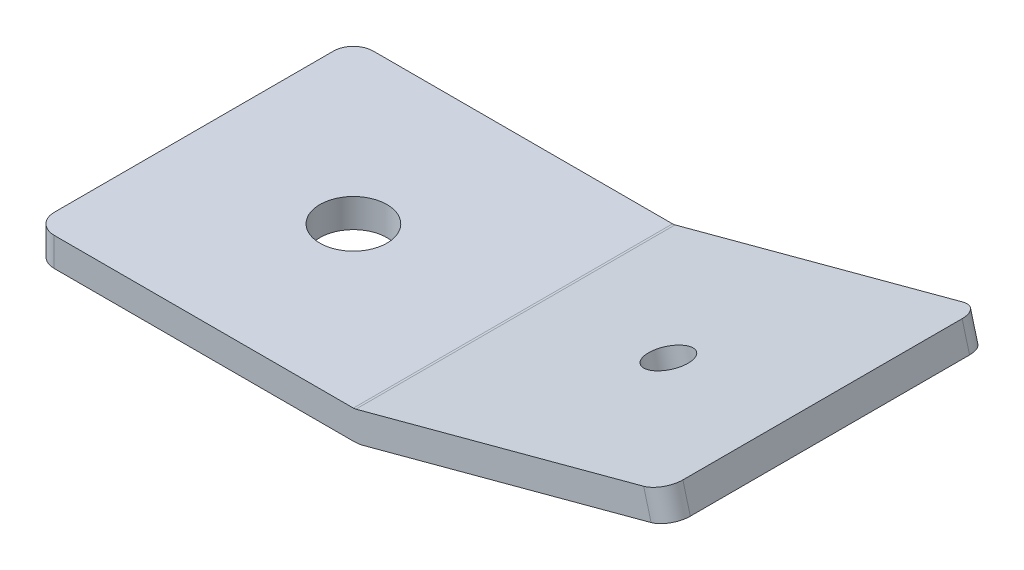
ISO-10303-21;
HEADER;
FILE_DESCRIPTION(('STEP AP214'),'2;1');
FILE_NAME('part.step','',(''),(''),'','','');
FILE_SCHEMA(('AUTOMOTIVE_DESIGN { 1 0 10303 214 1 1 1 1 }'));
ENDSEC;
DATA;
#1=APPLICATION_CONTEXT('core data for automotive mechanical design processes');
#2=APPLICATION_PROTOCOL_DEFINITION('international standard','automotive_design',2000,#1);
#3=PRODUCT_CONTEXT('',#1,'mechanical');
#4=PRODUCT('Part','Part','',(#3));
#5=PRODUCT_RELATED_PRODUCT_CATEGORY('part','',(#4));
#6=PRODUCT_DEFINITION_FORMATION('','',#4);
#7=PRODUCT_DEFINITION_CONTEXT('part definition',#1,'design');
#8=PRODUCT_DEFINITION('design','',#6,#7);
#9=PRODUCT_DEFINITION_SHAPE('','',#8);
#10=(LENGTH_UNIT() NAMED_UNIT(*) SI_UNIT(.MILLI.,.METRE.));
#11=(NAMED_UNIT(*) PLANE_ANGLE_UNIT() SI_UNIT($,.RADIAN.));
#12=(NAMED_UNIT(*) SI_UNIT($,.STERADIAN.) SOLID_ANGLE_UNIT());
#13=UNCERTAINTY_MEASURE_WITH_UNIT(LENGTH_MEASURE(1.E-05),#10,'distance_accuracy_value','');
#14=(GEOMETRIC_REPRESENTATION_CONTEXT(3) GLOBAL_UNCERTAINTY_ASSIGNED_CONTEXT((#13)) GLOBAL_UNIT_ASSIGNED_CONTEXT((#10,
#11,#12)) REPRESENTATION_CONTEXT('',''));
#15=CARTESIAN_POINT('',(0.,0.,0.));
#16=DIRECTION('',(0.,0.,1.));
#17=DIRECTION('',(1.,0.,0.));
#18=AXIS2_PLACEMENT_3D('',#15,#16,#17);
#19=CARTESIAN_POINT('',(0.,0.,-1.5875));
#20=DIRECTION('',(1.,0.,0.));
#21=DIRECTION('',(0.,0.,-1.));
#22=AXIS2_PLACEMENT_3D('',#19,#20,#21);
#23=PLANE('',#22);
#24=DIRECTION('',(0.,1.,0.));
#25=VECTOR('',#24,1.);
#26=CARTESIAN_POINT('',(0.,1.143,-23.8125000006107));
#27=LINE('',#26,#25);
#28=CARTESIAN_POINT('',(0.,2.286,-23.8125000003053));
#29=VERTEX_POINT('',#28);
#30=CARTESIAN_POINT('',(0.,0.,-23.8125000003053));
#31=VERTEX_POINT('',#30);
#32=EDGE_CURVE('E115',#29,#31,#27,.F.);
#33=ORIENTED_EDGE('',*,*,#32,.T.);
#34=DIRECTION('',(0.,0.,-1.));
#35=VECTOR('',#34,1.);
#36=CARTESIAN_POINT('',(0.,0.,-12.7));
#37=LINE('',#36,#35);
#38=CARTESIAN_POINT('',(0.,0.,-1.58750000030535));
#39=VERTEX_POINT('',#38);
#40=EDGE_CURVE('E159',#39,#31,#37,.T.);
#41=ORIENTED_EDGE('',*,*,#40,.F.);
#42=DIRECTION('',(0.,-1.,0.));
#43=VECTOR('',#42,1.);
#44=CARTESIAN_POINT('',(0.,1.143,-1.58750000061069));
#45=LINE('',#44,#43);
#46=CARTESIAN_POINT('',(0.,2.286,-1.58750000030535));
#47=VERTEX_POINT('',#46);
#48=EDGE_CURVE('E92',#39,#47,#45,.F.);
#49=ORIENTED_EDGE('',*,*,#48,.T.);
#50=DIRECTION('',(0.,0.,-1.));
#51=VECTOR('',#50,1.);
#52=CARTESIAN_POINT('',(0.,2.286,-12.7));
#53=LINE('',#52,#51);
#54=EDGE_CURVE('E89',#47,#29,#53,.T.);
#55=ORIENTED_EDGE('',*,*,#54,.T.);
#56=EDGE_LOOP('',(#33,#41,#49,#55));
#57=FACE_BOUND('',#56,.T.);
#58=ADVANCED_FACE('F17',(#57),#23,.F.);
#59=CARTESIAN_POINT('',(12.7,0.,-12.7));
#60=DIRECTION('',(0.,1.,0.));
#61=DIRECTION('',(0.,0.,1.));
#62=AXIS2_PLACEMENT_3D('',#59,#60,#61);
#63=CYLINDRICAL_SURFACE('',#62,2.667);
#64=CARTESIAN_POINT('',(12.7,2.286,-12.7));
#65=DIRECTION('',(0.,1.,0.));
#66=DIRECTION('',(0.,0.,1.));
#67=AXIS2_PLACEMENT_3D('',#64,#65,#66);
#68=CIRCLE('',#67,2.667);
#69=CARTESIAN_POINT('',(12.7,2.286,-10.033));
#70=VERTEX_POINT('',#69);
#71=EDGE_CURVE('E161',#70,#70,#68,.T.);
#72=ORIENTED_EDGE('',*,*,#71,.T.);
#73=EDGE_LOOP('',(#72));
#74=FACE_BOUND('',#73,.T.);
#75=CARTESIAN_POINT('',(12.7,0.,-12.7));
#76=DIRECTION('',(0.,1.,0.));
#77=DIRECTION('',(0.,0.,1.));
#78=AXIS2_PLACEMENT_3D('',#75,#76,#77);
#79=CIRCLE('',#78,2.667);
#80=CARTESIAN_POINT('',(12.7,0.,-10.033));
#81=VERTEX_POINT('',#80);
#82=EDGE_CURVE('E153',#81,#81,#79,.T.);
#83=ORIENTED_EDGE('',*,*,#82,.F.);
#84=EDGE_LOOP('',(#83));
#85=FACE_BOUND('',#84,.T.);
#86=ADVANCED_FACE('F288',(#74,#85),#63,.F.);
#87=CARTESIAN_POINT('',(1.5875,0.,-1.5875));
#88=DIRECTION('',(0.,1.,0.));
#89=DIRECTION('',(0.,0.,1.));
#90=AXIS2_PLACEMENT_3D('',#87,#88,#89);
#91=CYLINDRICAL_SURFACE('',#90,1.5875);
#92=CARTESIAN_POINT('',(1.5875,0.,-1.5875));
#93=DIRECTION('',(0.,1.,0.));
#94=DIRECTION('',(0.,0.,1.));
#95=AXIS2_PLACEMENT_3D('',#92,#93,#94);
#96=CIRCLE('',#95,1.5875);
#97=CARTESIAN_POINT('',(1.5875,0.,0.));
#98=VERTEX_POINT('',#97);
#99=EDGE_CURVE('E106',#98,#39,#96,.F.);
#100=ORIENTED_EDGE('',*,*,#99,.F.);
#101=DIRECTION('',(0.,1.,0.));
#102=VECTOR('',#101,1.);
#103=CARTESIAN_POINT('',(1.5875,4.2499116415,0.));
#104=LINE('',#103,#102);
#105=CARTESIAN_POINT('',(1.5875,2.286000000267,0.));
#106=VERTEX_POINT('',#105);
#107=EDGE_CURVE('E98',#98,#106,#104,.T.);
#108=ORIENTED_EDGE('',*,*,#107,.T.);
#109=CARTESIAN_POINT('',(1.5875,2.286,-1.5875));
#110=DIRECTION('',(0.,1.,0.));
#111=DIRECTION('',(0.,0.,1.));
#112=AXIS2_PLACEMENT_3D('',#109,#110,#111);
#113=CIRCLE('',#112,1.5875);
#114=EDGE_CURVE('E21',#106,#47,#113,.F.);
#115=ORIENTED_EDGE('',*,*,#114,.T.);
#116=ORIENTED_EDGE('',*,*,#48,.F.);
#117=EDGE_LOOP('',(#100,#108,#115,#116));
#118=FACE_BOUND('',#117,.T.);
#119=ADVANCED_FACE('F104',(#118),#91,.T.);
#120=CARTESIAN_POINT('',(0.,2.286,0.));
#121=DIRECTION('',(0.,-1.,0.));
#122=DIRECTION('',(0.,0.,-1.));
#123=AXIS2_PLACEMENT_3D('',#120,#121,#122);
#124=PLANE('',#123);
#125=ORIENTED_EDGE('',*,*,#71,.F.);
#126=EDGE_LOOP('',(#125));
#127=FACE_BOUND('',#126,.T.);
#128=DIRECTION('',(0.,0.,-1.));
#129=VECTOR('',#128,1.);
#130=CARTESIAN_POINT('',(25.4000000002931,2.28600000000001,-12.7));
#131=LINE('',#130,#129);
#132=CARTESIAN_POINT('',(25.4000000001466,2.286000000267,-25.4));
#133=VERTEX_POINT('',#132);
#134=CARTESIAN_POINT('',(25.4000000001466,2.286000000267,0.));
#135=VERTEX_POINT('',#134);
#136=EDGE_CURVE('E113',#133,#135,#131,.F.);
#137=ORIENTED_EDGE('',*,*,#136,.F.);
#138=DIRECTION('',(-1.,0.,0.));
#139=VECTOR('',#138,1.);
#140=CARTESIAN_POINT('',(25.482810904,2.286000000534,-25.4));
#141=LINE('',#140,#139);
#142=CARTESIAN_POINT('',(1.5875,2.286000000267,-25.4));
#143=VERTEX_POINT('',#142);
#144=EDGE_CURVE('E145',#133,#143,#141,.T.);
#145=ORIENTED_EDGE('',*,*,#144,.T.);
#146=CARTESIAN_POINT('',(1.5875,2.286,-23.8125));
#147=DIRECTION('',(0.,1.,0.));
#148=DIRECTION('',(0.,0.,1.));
#149=AXIS2_PLACEMENT_3D('',#146,#147,#148);
#150=CIRCLE('',#149,1.5875);
#151=EDGE_CURVE('E118',#143,#29,#150,.T.);
#152=ORIENTED_EDGE('',*,*,#151,.T.);
#153=ORIENTED_EDGE('',*,*,#54,.F.);
#154=ORIENTED_EDGE('',*,*,#114,.F.);
#155=DIRECTION('',(1.,0.,0.));
#156=VECTOR('',#155,1.);
#157=CARTESIAN_POINT('',(25.482810904,2.286000000534,0.));
#158=LINE('',#157,#156);
#159=EDGE_CURVE('E87',#106,#135,#158,.T.);
#160=ORIENTED_EDGE('',*,*,#159,.T.);
#161=EDGE_LOOP('',(#137,#145,#152,#153,#154,#160));
#162=FACE_BOUND('',#161,.T.);
#163=ADVANCED_FACE('F86',(#127,#162),#124,.F.);
#164=CARTESIAN_POINT('',(1.5875,0.,-23.8125));
#165=DIRECTION('',(0.,1.,0.));
#166=DIRECTION('',(0.,0.,1.));
#167=AXIS2_PLACEMENT_3D('',#164,#165,#166);
#168=CYLINDRICAL_SURFACE('',#167,1.5875);
#169=CARTESIAN_POINT('',(1.5875,0.,-23.8125));
#170=DIRECTION('',(0.,1.,0.));
#171=DIRECTION('',(0.,0.,1.));
#172=AXIS2_PLACEMENT_3D('',#169,#170,#171);
#173=CIRCLE('',#172,1.5875);
#174=CARTESIAN_POINT('',(1.5875,0.,-25.4));
#175=VERTEX_POINT('',#174);
#176=EDGE_CURVE('E157',#31,#175,#173,.F.);
#177=ORIENTED_EDGE('',*,*,#176,.F.);
#178=ORIENTED_EDGE('',*,*,#32,.F.);
#179=ORIENTED_EDGE('',*,*,#151,.F.);
#180=DIRECTION('',(0.,-1.,0.));
#181=VECTOR('',#180,1.);
#182=CARTESIAN_POINT('',(1.5875,4.2499116415,-25.4));
#183=LINE('',#182,#181);
#184=EDGE_CURVE('E168',#143,#175,#183,.T.);
#185=ORIENTED_EDGE('',*,*,#184,.T.);
#186=EDGE_LOOP('',(#177,#178,#179,#185));
#187=FACE_BOUND('',#186,.T.);
#188=ADVANCED_FACE('F229',(#187),#168,.T.);
#189=CARTESIAN_POINT('',(0.,0.,0.));
#190=DIRECTION('',(0.,-1.,0.));
#191=DIRECTION('',(0.,0.,-1.));
#192=AXIS2_PLACEMENT_3D('',#189,#190,#191);
#193=PLANE('',#192);
#194=ORIENTED_EDGE('',*,*,#82,.T.);
#195=EDGE_LOOP('',(#194));
#196=FACE_BOUND('',#195,.T.);
#197=ORIENTED_EDGE('',*,*,#176,.T.);
#198=DIRECTION('',(1.,0.,0.));
#199=VECTOR('',#198,1.);
#200=CARTESIAN_POINT('',(25.482810904,0.,-25.4));
#201=LINE('',#200,#199);
#202=CARTESIAN_POINT('',(25.4000000005863,0.,-25.4));
#203=VERTEX_POINT('',#202);
#204=EDGE_CURVE('E141',#175,#203,#201,.T.);
#205=ORIENTED_EDGE('',*,*,#204,.T.);
#206=DIRECTION('',(0.,0.,-1.));
#207=VECTOR('',#206,1.);
#208=CARTESIAN_POINT('',(25.4000000011725,0.,-12.7));
#209=LINE('',#208,#207);
#210=CARTESIAN_POINT('',(25.4000000005863,0.,0.));
#211=VERTEX_POINT('',#210);
#212=EDGE_CURVE('E156',#203,#211,#209,.F.);
#213=ORIENTED_EDGE('',*,*,#212,.T.);
#214=DIRECTION('',(-1.,0.,0.));
#215=VECTOR('',#214,1.);
#216=CARTESIAN_POINT('',(25.482810904,0.,0.));
#217=LINE('',#216,#215);
#218=EDGE_CURVE('E107',#211,#98,#217,.T.);
#219=ORIENTED_EDGE('',*,*,#218,.T.);
#220=ORIENTED_EDGE('',*,*,#99,.T.);
#221=ORIENTED_EDGE('',*,*,#40,.T.);
#222=EDGE_LOOP('',(#197,#205,#213,#219,#220,#221));
#223=FACE_BOUND('',#222,.T.);
#224=ADVANCED_FACE('F232',(#196,#223),#193,.T.);
#225=CARTESIAN_POINT('',(25.4,3.048,0.));
#226=DIRECTION('',(0.,0.,-1.));
#227=DIRECTION('',(-1.,0.,0.));
#228=AXIS2_PLACEMENT_3D('',#225,#226,#227);
#229=CYLINDRICAL_SURFACE('',#228,3.048);
#230=ORIENTED_EDGE('',*,*,#212,.F.);
#231=CARTESIAN_POINT('',(25.4,3.048,-25.4));
#232=DIRECTION('',(0.,0.,-1.));
#233=DIRECTION('',(-1.,0.,0.));
#234=AXIS2_PLACEMENT_3D('',#231,#232,#233);
#235=CIRCLE('',#234,3.048);
#236=CARTESIAN_POINT('',(26.1888804493152,0.103858081084461,-25.4));
#237=VERTEX_POINT('',#236);
#238=EDGE_CURVE('E138',#203,#237,#235,.F.);
#239=ORIENTED_EDGE('',*,*,#238,.T.);
#240=DIRECTION('',(0.,0.,1.));
#241=VECTOR('',#240,1.);
#242=CARTESIAN_POINT('',(26.188880449,0.103858081,-12.7));
#243=LINE('',#242,#241);
#244=CARTESIAN_POINT('',(26.1888804493152,0.103858081084461,0.));
#245=VERTEX_POINT('',#244);
#246=EDGE_CURVE('E173',#237,#245,#243,.T.);
#247=ORIENTED_EDGE('',*,*,#246,.T.);
#248=CARTESIAN_POINT('',(25.4,3.048,0.));
#249=DIRECTION('',(0.,0.,-1.));
#250=DIRECTION('',(-1.,0.,0.));
#251=AXIS2_PLACEMENT_3D('',#248,#249,#250);
#252=CIRCLE('',#251,3.048);
#253=EDGE_CURVE('E109',#245,#211,#252,.T.);
#254=ORIENTED_EDGE('',*,*,#253,.T.);
#255=EDGE_LOOP('',(#230,#239,#247,#254));
#256=FACE_BOUND('',#255,.T.);
#257=ADVANCED_FACE('F235',(#256),#229,.T.);
#258=CARTESIAN_POINT('',(25.4,3.048,0.));
#259=DIRECTION('',(0.,0.,-1.));
#260=DIRECTION('',(-1.,0.,0.));
#261=AXIS2_PLACEMENT_3D('',#258,#259,#260);
#262=CYLINDRICAL_SURFACE('',#261,0.761999999999995);
#263=ORIENTED_EDGE('',*,*,#136,.T.);
#264=CARTESIAN_POINT('',(25.4,3.048,0.));
#265=DIRECTION('',(0.,0.,-1.));
#266=DIRECTION('',(-1.,0.,0.));
#267=AXIS2_PLACEMENT_3D('',#264,#265,#266);
#268=CIRCLE('',#267,0.761999999999995);
#269=CARTESIAN_POINT('',(25.5972201122267,2.31196452006074,0.));
#270=VERTEX_POINT('',#269);
#271=EDGE_CURVE('E102',#135,#270,#268,.F.);
#272=ORIENTED_EDGE('',*,*,#271,.T.);
#273=DIRECTION('',(0.,0.,1.));
#274=VECTOR('',#273,1.);
#275=CARTESIAN_POINT('',(25.597220112,2.31196452,-12.7));
#276=LINE('',#275,#274);
#277=CARTESIAN_POINT('',(25.5972201122267,2.31196452006074,-25.4));
#278=VERTEX_POINT('',#277);
#279=EDGE_CURVE('E184',#278,#270,#276,.T.);
#280=ORIENTED_EDGE('',*,*,#279,.F.);
#281=CARTESIAN_POINT('',(25.4,3.048,-25.4));
#282=DIRECTION('',(0.,0.,-1.));
#283=DIRECTION('',(-1.,0.,0.));
#284=AXIS2_PLACEMENT_3D('',#281,#282,#283);
#285=CIRCLE('',#284,0.761999999999995);
#286=EDGE_CURVE('E142',#278,#133,#285,.T.);
#287=ORIENTED_EDGE('',*,*,#286,.T.);
#288=EDGE_LOOP('',(#263,#272,#280,#287));
#289=FACE_BOUND('',#288,.T.);
#290=ADVANCED_FACE('F206',(#289),#262,.F.);
#291=CARTESIAN_POINT('',(49.378121808,0.,0.));
#292=DIRECTION('',(0.,0.,-1.));
#293=DIRECTION('',(-1.,0.,0.));
#294=AXIS2_PLACEMENT_3D('',#291,#292,#293);
#295=PLANE('',#294);
#296=ORIENTED_EDGE('',*,*,#271,.F.);
#297=ORIENTED_EDGE('',*,*,#159,.F.);
#298=ORIENTED_EDGE('',*,*,#107,.F.);
#299=ORIENTED_EDGE('',*,*,#218,.F.);
#300=ORIENTED_EDGE('',*,*,#253,.F.);
#301=DIRECTION('',(0.965925826282751,0.258819045126098,0.));
#302=VECTOR('',#301,1.);
#303=CARTESIAN_POINT('',(38.4076879885,3.377877694,0.));
#304=LINE('',#303,#302);
#305=CARTESIAN_POINT('',(49.0930882791477,6.24102207307794,-1.25930082334191E-10));
#306=VERTEX_POINT('',#305);
#307=EDGE_CURVE('E175',#245,#306,#304,.T.);
#308=ORIENTED_EDGE('',*,*,#307,.T.);
#309=DIRECTION('',(0.258819045102986,-0.965925826288944,-4.79490924594367E-10));
#310=VECTOR('',#309,1.);
#311=CARTESIAN_POINT('',(48.7972581108343,7.34507529226192,2.96197094629136E-10));
#312=LINE('',#311,#310);
#313=CARTESIAN_POINT('',(48.5014279422065,8.44912851136163,4.22128044325065E-10));
#314=VERTEX_POINT('',#313);
#315=EDGE_CURVE('E150',#306,#314,#312,.F.);
#316=ORIENTED_EDGE('',*,*,#315,.T.);
#317=DIRECTION('',(0.965925826282751,0.258819045126098,0.));
#318=VECTOR('',#317,1.);
#319=CARTESIAN_POINT('',(37.8160276515,5.585984133,0.));
#320=LINE('',#319,#318);
#321=EDGE_CURVE('E129',#270,#314,#320,.T.);
#322=ORIENTED_EDGE('',*,*,#321,.F.);
#323=EDGE_LOOP('',(#296,#297,#298,#299,#300,#308,#316,#322));
#324=FACE_BOUND('',#323,.T.);
#325=ADVANCED_FACE('F96',(#324),#295,.F.);
#326=CARTESIAN_POINT('',(49.0930882789904,6.2410220730358,-1.5875));
#327=DIRECTION('',(-0.258819045102984,0.965925826288944,0.));
#328=DIRECTION('',(-0.965925826288944,-0.258819045102984,0.));
#329=AXIS2_PLACEMENT_3D('',#326,#327,#328);
#330=CYLINDRICAL_SURFACE('',#329,1.58750000029619);
#331=CARTESIAN_POINT('',(49.0930882789904,6.2410220730358,-1.5875));
#332=DIRECTION('',(-0.258819045102984,0.965925826288944,0.));
#333=DIRECTION('',(-0.965925826288944,-0.258819045102984,0.));
#334=AXIS2_PLACEMENT_3D('',#331,#332,#333);
#335=CIRCLE('',#334,1.58750000029619);
#336=CARTESIAN_POINT('',(50.6264955279904,6.6518973070358,-1.5875));
#337=VERTEX_POINT('',#336);
#338=EDGE_CURVE('E135',#306,#337,#335,.T.);
#339=ORIENTED_EDGE('',*,*,#338,.T.);
#340=DIRECTION('',(-0.258819045048643,0.965925826303505,0.));
#341=VECTOR('',#340,1.);
#342=CARTESIAN_POINT('',(50.3306653595,7.7559505265,-1.5875));
#343=LINE('',#342,#341);
#344=CARTESIAN_POINT('',(50.0348351910819,8.86000374569429,-1.5875));
#345=VERTEX_POINT('',#344);
#346=EDGE_CURVE('E179',#337,#345,#343,.T.);
#347=ORIENTED_EDGE('',*,*,#346,.T.);
#348=CARTESIAN_POINT('',(48.5014279420492,8.4491285113195,-1.5875));
#349=DIRECTION('',(-0.258819045102984,0.965925826288944,0.));
#350=DIRECTION('',(-0.965925826288944,-0.258819045102984,0.));
#351=AXIS2_PLACEMENT_3D('',#348,#349,#350);
#352=CIRCLE('',#351,1.58750000029619);
#353=EDGE_CURVE('E126',#314,#345,#352,.T.);
#354=ORIENTED_EDGE('',*,*,#353,.F.);
#355=ORIENTED_EDGE('',*,*,#315,.F.);
#356=EDGE_LOOP('',(#339,#347,#354,#355));
#357=FACE_BOUND('',#356,.T.);
#358=ADVANCED_FACE('F249',(#357),#330,.T.);
#359=CARTESIAN_POINT('',(50.034835191,8.860003746,-23.8125));
#360=DIRECTION('',(-0.965925826303505,-0.258819045048643,0.));
#361=DIRECTION('',(0.258819045048643,-0.965925826303505,0.));
#362=AXIS2_PLACEMENT_3D('',#359,#360,#361);
#363=PLANE('',#362);
#364=DIRECTION('',(0.258819044639828,-0.965925826413046,0.));
#365=VECTOR('',#364,1.);
#366=CARTESIAN_POINT('',(50.3306653600396,7.7559505263553,-23.8125000006512));
#367=LINE('',#366,#365);
#368=CARTESIAN_POINT('',(50.6264955279904,6.6518973070358,-23.8125000003256));
#369=VERTEX_POINT('',#368);
#370=CARTESIAN_POINT('',(50.0348351916311,8.86000374551379,-23.8125000003256));
#371=VERTEX_POINT('',#370);
#372=EDGE_CURVE('E148',#369,#371,#367,.F.);
#373=ORIENTED_EDGE('',*,*,#372,.T.);
#374=DIRECTION('',(0.,0.,-1.));
#375=VECTOR('',#374,1.);
#376=CARTESIAN_POINT('',(50.034835191,8.860003746,-12.7));
#377=LINE('',#376,#375);
#378=EDGE_CURVE('E125',#345,#371,#377,.T.);
#379=ORIENTED_EDGE('',*,*,#378,.F.);
#380=ORIENTED_EDGE('',*,*,#346,.F.);
#381=DIRECTION('',(0.,0.,-1.));
#382=VECTOR('',#381,1.);
#383=CARTESIAN_POINT('',(50.626495528,6.651897307,-12.7));
#384=LINE('',#383,#382);
#385=EDGE_CURVE('E134',#337,#369,#384,.T.);
#386=ORIENTED_EDGE('',*,*,#385,.T.);
#387=EDGE_LOOP('',(#373,#379,#380,#386));
#388=FACE_BOUND('',#387,.T.);
#389=ADVANCED_FACE('F246',(#388),#363,.F.);
#390=CARTESIAN_POINT('',(49.0930882789904,6.2410220730358,-23.8125));
#391=DIRECTION('',(-0.258819045102984,0.965925826288944,0.));
#392=DIRECTION('',(-0.965925826288944,-0.258819045102984,0.));
#393=AXIS2_PLACEMENT_3D('',#390,#391,#392);
#394=CYLINDRICAL_SURFACE('',#393,1.58750000029619);
#395=CARTESIAN_POINT('',(49.0930882789904,6.2410220730358,-23.8125));
#396=DIRECTION('',(-0.258819045102984,0.965925826288944,0.));
#397=DIRECTION('',(-0.965925826288944,-0.258819045102984,0.));
#398=AXIS2_PLACEMENT_3D('',#395,#396,#397);
#399=CIRCLE('',#398,1.58750000029619);
#400=CARTESIAN_POINT('',(49.093088275137,6.24102207200327,-25.4000000001481));
#401=VERTEX_POINT('',#400);
#402=EDGE_CURVE('E130',#369,#401,#399,.T.);
#403=ORIENTED_EDGE('',*,*,#402,.T.);
#404=DIRECTION('',(-0.258819045102984,0.965925826288944,0.));
#405=VECTOR('',#404,1.);
#406=CARTESIAN_POINT('',(49.0930882712835,6.24102207097075,-25.4000000002962));
#407=LINE('',#406,#405);
#408=CARTESIAN_POINT('',(48.5014279381188,8.44912851057434,-25.400000000074));
#409=VERTEX_POINT('',#408);
#410=EDGE_CURVE('E146',#401,#409,#407,.T.);
#411=ORIENTED_EDGE('',*,*,#410,.T.);
#412=CARTESIAN_POINT('',(48.5014279420492,8.4491285113195,-23.8125));
#413=DIRECTION('',(-0.258819045102984,0.965925826288944,0.));
#414=DIRECTION('',(-0.965925826288944,-0.258819045102984,0.));
#415=AXIS2_PLACEMENT_3D('',#412,#413,#414);
#416=CIRCLE('',#415,1.58750000029619);
#417=EDGE_CURVE('E36',#371,#409,#416,.T.);
#418=ORIENTED_EDGE('',*,*,#417,.F.);
#419=ORIENTED_EDGE('',*,*,#372,.F.);
#420=EDGE_LOOP('',(#403,#411,#418,#419));
#421=FACE_BOUND('',#420,.T.);
#422=ADVANCED_FACE('F243',(#421),#394,.T.);
#423=CARTESIAN_POINT('',(1.5875,0.,-25.4));
#424=DIRECTION('',(0.,0.,1.));
#425=DIRECTION('',(1.,0.,0.));
#426=AXIS2_PLACEMENT_3D('',#423,#424,#425);
#427=PLANE('',#426);
#428=ORIENTED_EDGE('',*,*,#238,.F.);
#429=ORIENTED_EDGE('',*,*,#204,.F.);
#430=ORIENTED_EDGE('',*,*,#184,.F.);
#431=ORIENTED_EDGE('',*,*,#144,.F.);
#432=ORIENTED_EDGE('',*,*,#286,.F.);
#433=DIRECTION('',(-0.965925826282751,-0.258819045126098,0.));
#434=VECTOR('',#433,1.);
#435=CARTESIAN_POINT('',(37.8160276515,5.585984133,-25.4));
#436=LINE('',#435,#434);
#437=EDGE_CURVE('E123',#409,#278,#436,.T.);
#438=ORIENTED_EDGE('',*,*,#437,.F.);
#439=ORIENTED_EDGE('',*,*,#410,.F.);
#440=DIRECTION('',(-0.965925826282751,-0.258819045126098,0.));
#441=VECTOR('',#440,1.);
#442=CARTESIAN_POINT('',(38.4076879885,3.377877694,-25.4));
#443=LINE('',#442,#441);
#444=EDGE_CURVE('E133',#401,#237,#443,.T.);
#445=ORIENTED_EDGE('',*,*,#444,.T.);
#446=EDGE_LOOP('',(#428,#429,#430,#431,#432,#438,#439,#445));
#447=FACE_BOUND('',#446,.T.);
#448=ADVANCED_FACE('F225',(#447),#427,.F.);
#449=CARTESIAN_POINT('',(50.626495528,6.651897307,-25.4));
#450=DIRECTION('',(-0.258819045126098,0.965925826282751,0.));
#451=DIRECTION('',(-0.965925826282751,-0.258819045126098,0.));
#452=AXIS2_PLACEMENT_3D('',#449,#450,#451);
#453=PLANE('',#452);
#454=CARTESIAN_POINT('',(38.359237534085,3.36489543368286,-12.7));
#455=DIRECTION('',(-0.258819045102051,0.965925826289194,0.));
#456=DIRECTION('',(-0.965925826289194,-0.258819045102051,0.));
#457=AXIS2_PLACEMENT_3D('',#454,#455,#456);
#458=CIRCLE('',#457,1.62559999980145);
#459=CARTESIAN_POINT('',(36.789028511061,2.94415919401636,-12.7));
#460=VERTEX_POINT('',#459);
#461=EDGE_CURVE('E27',#460,#460,#458,.F.);
#462=ORIENTED_EDGE('',*,*,#461,.F.);
#463=EDGE_LOOP('',(#462));
#464=FACE_BOUND('',#463,.T.);
#465=ORIENTED_EDGE('',*,*,#246,.F.);
#466=ORIENTED_EDGE('',*,*,#444,.F.);
#467=ORIENTED_EDGE('',*,*,#402,.F.);
#468=ORIENTED_EDGE('',*,*,#385,.F.);
#469=ORIENTED_EDGE('',*,*,#338,.F.);
#470=ORIENTED_EDGE('',*,*,#307,.F.);
#471=EDGE_LOOP('',(#465,#466,#467,#468,#469,#470));
#472=FACE_BOUND('',#471,.T.);
#473=ADVANCED_FACE('F239',(#464,#472),#453,.F.);
#474=CARTESIAN_POINT('',(50.034835191,8.860003746,-25.4));
#475=DIRECTION('',(-0.258819045126098,0.965925826282751,0.));
#476=DIRECTION('',(-0.965925826282751,-0.258819045126098,0.));
#477=AXIS2_PLACEMENT_3D('',#474,#475,#476);
#478=PLANE('',#477);
#479=CARTESIAN_POINT('',(37.7675771969629,5.57300187265015,-12.7));
#480=DIRECTION('',(-0.258819045102051,0.965925826289194,0.));
#481=DIRECTION('',(-0.965925826289194,-0.258819045102051,0.));
#482=AXIS2_PLACEMENT_3D('',#479,#480,#481);
#483=CIRCLE('',#482,1.62559999980145);
#484=CARTESIAN_POINT('',(36.197368173939,5.15226563298364,-12.7));
#485=VERTEX_POINT('',#484);
#486=EDGE_CURVE('E11',#485,#485,#483,.T.);
#487=ORIENTED_EDGE('',*,*,#486,.F.);
#488=EDGE_LOOP('',(#487));
#489=FACE_BOUND('',#488,.T.);
#490=ORIENTED_EDGE('',*,*,#417,.T.);
#491=ORIENTED_EDGE('',*,*,#437,.T.);
#492=ORIENTED_EDGE('',*,*,#279,.T.);
#493=ORIENTED_EDGE('',*,*,#321,.T.);
#494=ORIENTED_EDGE('',*,*,#353,.T.);
#495=ORIENTED_EDGE('',*,*,#378,.T.);
#496=EDGE_LOOP('',(#490,#491,#492,#493,#494,#495));
#497=FACE_BOUND('',#496,.T.);
#498=ADVANCED_FACE('F19',(#489,#497),#478,.T.);
#499=CARTESIAN_POINT('',(38.359237534085,3.36489543368286,-12.7));
#500=DIRECTION('',(-0.258819045102051,0.965925826289194,0.));
#501=DIRECTION('',(-0.965925826289194,-0.258819045102051,0.));
#502=AXIS2_PLACEMENT_3D('',#499,#500,#501);
#503=CYLINDRICAL_SURFACE('',#502,1.62559999980145);
#504=ORIENTED_EDGE('',*,*,#486,.T.);
#505=EDGE_LOOP('',(#504));
#506=FACE_BOUND('',#505,.T.);
#507=ORIENTED_EDGE('',*,*,#461,.T.);
#508=EDGE_LOOP('',(#507));
#509=FACE_BOUND('',#508,.T.);
#510=ADVANCED_FACE('F261',(#506,#509),#503,.F.);
#511=CLOSED_SHELL('',(#58,#86,#119,#163,#188,#224,#257,#290,#325,#358,#389,#422,#448,#473,#498,#510));
#512=MANIFOLD_SOLID_BREP('B1',#511);
#513=ADVANCED_BREP_SHAPE_REPRESENTATION('',(#18,#512),#14);
#514=SHAPE_DEFINITION_REPRESENTATION(#9,#513);
ENDSEC;
END-ISO-10303-21;
